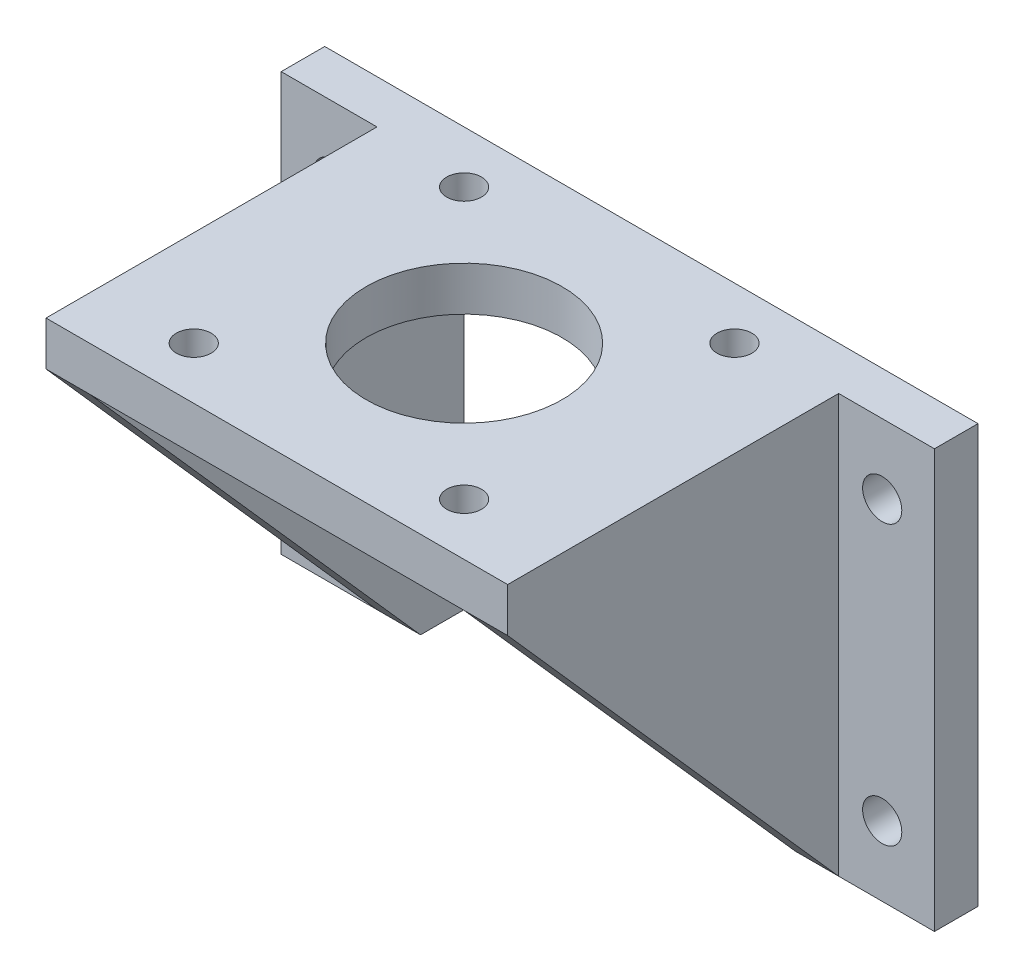
ISO-10303-21;
HEADER;
FILE_DESCRIPTION(('STEP AP214'),'2;1');
FILE_NAME('part.step','',(''),(''),'','','');
FILE_SCHEMA(('AUTOMOTIVE_DESIGN { 1 0 10303 214 1 1 1 1 }'));
ENDSEC;
DATA;
#1=APPLICATION_CONTEXT('core data for automotive mechanical design processes');
#2=APPLICATION_PROTOCOL_DEFINITION('international standard','automotive_design',2000,#1);
#3=PRODUCT_CONTEXT('',#1,'mechanical');
#4=PRODUCT('Part','Part','',(#3));
#5=PRODUCT_RELATED_PRODUCT_CATEGORY('part','',(#4));
#6=PRODUCT_DEFINITION_FORMATION('','',#4);
#7=PRODUCT_DEFINITION_CONTEXT('part definition',#1,'design');
#8=PRODUCT_DEFINITION('design','',#6,#7);
#9=PRODUCT_DEFINITION_SHAPE('','',#8);
#10=(LENGTH_UNIT() NAMED_UNIT(*) SI_UNIT(.MILLI.,.METRE.));
#11=(NAMED_UNIT(*) PLANE_ANGLE_UNIT() SI_UNIT($,.RADIAN.));
#12=(NAMED_UNIT(*) SI_UNIT($,.STERADIAN.) SOLID_ANGLE_UNIT());
#13=UNCERTAINTY_MEASURE_WITH_UNIT(LENGTH_MEASURE(1.E-05),#10,'distance_accuracy_value','');
#14=(GEOMETRIC_REPRESENTATION_CONTEXT(3) GLOBAL_UNCERTAINTY_ASSIGNED_CONTEXT((#13)) GLOBAL_UNIT_ASSIGNED_CONTEXT((#10,
#11,#12)) REPRESENTATION_CONTEXT('',''));
#15=CARTESIAN_POINT('',(0.,0.,0.));
#16=DIRECTION('',(0.,0.,1.));
#17=DIRECTION('',(1.,0.,0.));
#18=AXIS2_PLACEMENT_3D('',#15,#16,#17);
#19=CARTESIAN_POINT('',(0.,0.,5.));
#20=DIRECTION('',(0.,0.,-1.));
#21=DIRECTION('',(-1.,0.,0.));
#22=AXIS2_PLACEMENT_3D('',#19,#20,#21);
#23=PLANE('',#22);
#24=DIRECTION('',(0.,1.,0.));
#25=VECTOR('',#24,1.);
#26=CARTESIAN_POINT('',(35.2765551342242,0.,5.));
#27=LINE('',#26,#25);
#28=CARTESIAN_POINT('',(35.2765551342242,42.930717043,5.));
#29=VERTEX_POINT('',#28);
#30=CARTESIAN_POINT('',(35.2765551342242,43.,5.));
#31=VERTEX_POINT('',#30);
#32=EDGE_CURVE('E11',#29,#31,#27,.T.);
#33=ORIENTED_EDGE('',*,*,#32,.F.);
#34=DIRECTION('',(1.,0.,0.));
#35=VECTOR('',#34,1.);
#36=CARTESIAN_POINT('',(-5.,42.930717043,5.));
#37=LINE('',#36,#35);
#38=CARTESIAN_POINT('',(7.72344486577579,42.930717043,5.));
#39=VERTEX_POINT('',#38);
#40=EDGE_CURVE('E170',#39,#29,#37,.T.);
#41=ORIENTED_EDGE('',*,*,#40,.F.);
#42=DIRECTION('',(0.,1.,0.));
#43=VECTOR('',#42,1.);
#44=CARTESIAN_POINT('',(7.7234448657758,0.,5.));
#45=LINE('',#44,#43);
#46=CARTESIAN_POINT('',(7.72344486577579,43.,5.));
#47=VERTEX_POINT('',#46);
#48=EDGE_CURVE('E262',#47,#39,#45,.F.);
#49=ORIENTED_EDGE('',*,*,#48,.F.);
#50=DIRECTION('',(1.,0.,0.));
#51=VECTOR('',#50,1.);
#52=CARTESIAN_POINT('',(0.,43.,5.));
#53=LINE('',#52,#51);
#54=EDGE_CURVE('E241',#47,#31,#53,.T.);
#55=ORIENTED_EDGE('',*,*,#54,.T.);
#56=EDGE_LOOP('',(#33,#41,#49,#55));
#57=FACE_BOUND('',#56,.T.);
#58=ADVANCED_FACE('F32',(#57),#23,.T.);
#59=DIRECTION('',(0.,1.,0.));
#60=VECTOR('',#59,1.);
#61=CARTESIAN_POINT('',(4.2365551342242,0.,5.));
#62=LINE('',#61,#60);
#63=CARTESIAN_POINT('',(4.23655513422419,42.930717043,5.));
#64=VERTEX_POINT('',#63);
#65=CARTESIAN_POINT('',(4.23655513422419,43.,5.));
#66=VERTEX_POINT('',#65);
#67=EDGE_CURVE('E161',#64,#66,#62,.T.);
#68=ORIENTED_EDGE('',*,*,#67,.F.);
#69=CARTESIAN_POINT('',(0.,42.930717043,5.));
#70=VERTEX_POINT('',#69);
#71=EDGE_CURVE('E179',#70,#64,#37,.T.);
#72=ORIENTED_EDGE('',*,*,#71,.F.);
#73=DIRECTION('',(0.,1.,0.));
#74=VECTOR('',#73,1.);
#75=CARTESIAN_POINT('',(0.,0.,5.));
#76=LINE('',#75,#74);
#77=CARTESIAN_POINT('',(0.,43.,5.));
#78=VERTEX_POINT('',#77);
#79=EDGE_CURVE('E233',#70,#78,#76,.T.);
#80=ORIENTED_EDGE('',*,*,#79,.T.);
#81=EDGE_CURVE('E238',#78,#66,#53,.T.);
#82=ORIENTED_EDGE('',*,*,#81,.T.);
#83=EDGE_LOOP('',(#68,#72,#80,#82));
#84=FACE_BOUND('',#83,.T.);
#85=ADVANCED_FACE('F414',(#84),#23,.T.);
#86=CARTESIAN_POINT('',(-5.,42.930717043,43.));
#87=DIRECTION('',(0.,1.,0.));
#88=DIRECTION('',(0.,0.,1.));
#89=AXIS2_PLACEMENT_3D('',#86,#87,#88);
#90=PLANE('',#89);
#91=CARTESIAN_POINT('',(5.98000000000032,42.930717043,37.02));
#92=DIRECTION('',(0.,1.,0.));
#93=DIRECTION('',(0.,0.,1.));
#94=AXIS2_PLACEMENT_3D('',#91,#92,#93);
#95=CIRCLE('',#94,2.);
#96=CARTESIAN_POINT('',(5.98000000000032,42.930717043,39.02));
#97=VERTEX_POINT('',#96);
#98=EDGE_CURVE('E381',#97,#97,#95,.T.);
#99=ORIENTED_EDGE('',*,*,#98,.T.);
#100=EDGE_LOOP('',(#99));
#101=FACE_BOUND('',#100,.T.);
#102=CARTESIAN_POINT('',(37.0200000000003,42.930717043,37.02));
#103=DIRECTION('',(0.,1.,0.));
#104=DIRECTION('',(0.,0.,1.));
#105=AXIS2_PLACEMENT_3D('',#102,#103,#104);
#106=CIRCLE('',#105,2.);
#107=CARTESIAN_POINT('',(37.0200000000003,42.930717043,39.02));
#108=VERTEX_POINT('',#107);
#109=EDGE_CURVE('E375',#108,#108,#106,.T.);
#110=ORIENTED_EDGE('',*,*,#109,.T.);
#111=EDGE_LOOP('',(#110));
#112=FACE_BOUND('',#111,.T.);
#113=CARTESIAN_POINT('',(21.5,42.930717043,21.5));
#114=DIRECTION('',(0.,1.,0.));
#115=DIRECTION('',(0.,0.,1.));
#116=AXIS2_PLACEMENT_3D('',#113,#114,#115);
#117=CIRCLE('',#116,11.25);
#118=CARTESIAN_POINT('',(21.5,42.930717043,32.75));
#119=VERTEX_POINT('',#118);
#120=EDGE_CURVE('E359',#119,#119,#117,.T.);
#121=ORIENTED_EDGE('',*,*,#120,.T.);
#122=EDGE_LOOP('',(#121));
#123=FACE_BOUND('',#122,.T.);
#124=ORIENTED_EDGE('',*,*,#40,.T.);
#125=CARTESIAN_POINT('',(37.02,42.930717043,5.98));
#126=DIRECTION('',(0.,1.,0.));
#127=DIRECTION('',(0.,0.,1.));
#128=AXIS2_PLACEMENT_3D('',#125,#126,#127);
#129=CIRCLE('',#128,2.);
#130=CARTESIAN_POINT('',(38.7634448657758,42.930717043,5.));
#131=VERTEX_POINT('',#130);
#132=EDGE_CURVE('E156',#29,#131,#129,.T.);
#133=ORIENTED_EDGE('',*,*,#132,.T.);
#134=CARTESIAN_POINT('',(43.,42.930717043,5.));
#135=VERTEX_POINT('',#134);
#136=EDGE_CURVE('E166',#131,#135,#37,.T.);
#137=ORIENTED_EDGE('',*,*,#136,.T.);
#138=DIRECTION('',(0.,0.,-1.));
#139=VECTOR('',#138,1.);
#140=CARTESIAN_POINT('',(43.,42.930717043,43.));
#141=LINE('',#140,#139);
#142=CARTESIAN_POINT('',(43.,42.930717043,43.));
#143=VERTEX_POINT('',#142);
#144=EDGE_CURVE('E323',#143,#135,#141,.T.);
#145=ORIENTED_EDGE('',*,*,#144,.F.);
#146=DIRECTION('',(1.,0.,0.));
#147=VECTOR('',#146,1.);
#148=CARTESIAN_POINT('',(-5.,42.930717043,43.));
#149=LINE('',#148,#147);
#150=CARTESIAN_POINT('',(0.,42.930717043,43.));
#151=VERTEX_POINT('',#150);
#152=EDGE_CURVE('E195',#151,#143,#149,.T.);
#153=ORIENTED_EDGE('',*,*,#152,.F.);
#154=DIRECTION('',(0.,0.,1.));
#155=VECTOR('',#154,1.);
#156=CARTESIAN_POINT('',(0.,42.930717043,43.));
#157=LINE('',#156,#155);
#158=EDGE_CURVE('E180',#70,#151,#157,.T.);
#159=ORIENTED_EDGE('',*,*,#158,.F.);
#160=ORIENTED_EDGE('',*,*,#71,.T.);
#161=CARTESIAN_POINT('',(5.97999999999999,42.930717043,5.98));
#162=DIRECTION('',(0.,1.,0.));
#163=DIRECTION('',(0.,0.,1.));
#164=AXIS2_PLACEMENT_3D('',#161,#162,#163);
#165=CIRCLE('',#164,2.);
#166=EDGE_CURVE('E366',#64,#39,#165,.T.);
#167=ORIENTED_EDGE('',*,*,#166,.T.);
#168=EDGE_LOOP('',(#124,#133,#137,#145,#153,#159,#160,#167));
#169=FACE_BOUND('',#168,.T.);
#170=ADVANCED_FACE('F164',(#101,#112,#123,#169),#90,.F.);
#171=CARTESIAN_POINT('',(0.,0.,5.));
#172=DIRECTION('',(0.,0.,1.));
#173=DIRECTION('',(1.,0.,0.));
#174=AXIS2_PLACEMENT_3D('',#171,#172,#173);
#175=PLANE('',#174);
#176=DIRECTION('',(1.,0.,0.));
#177=VECTOR('',#176,1.);
#178=CARTESIAN_POINT('',(-16.,0.,5.));
#179=LINE('',#178,#177);
#180=CARTESIAN_POINT('',(-16.,0.,5.));
#181=VERTEX_POINT('',#180);
#182=CARTESIAN_POINT('',(-5.,0.,5.));
#183=VERTEX_POINT('',#182);
#184=EDGE_CURVE('E230',#181,#183,#179,.T.);
#185=ORIENTED_EDGE('',*,*,#184,.T.);
#186=DIRECTION('',(0.,-1.,0.));
#187=VECTOR('',#186,1.);
#188=CARTESIAN_POINT('',(-5.,42.930717043,5.));
#189=LINE('',#188,#187);
#190=CARTESIAN_POINT('',(-5.,48.,5.));
#191=VERTEX_POINT('',#190);
#192=EDGE_CURVE('E177',#191,#183,#189,.T.);
#193=ORIENTED_EDGE('',*,*,#192,.F.);
#194=DIRECTION('',(-1.,0.,0.));
#195=VECTOR('',#194,1.);
#196=CARTESIAN_POINT('',(59.,48.,5.));
#197=LINE('',#196,#195);
#198=CARTESIAN_POINT('',(-16.,48.,5.));
#199=VERTEX_POINT('',#198);
#200=EDGE_CURVE('E249',#191,#199,#197,.T.);
#201=ORIENTED_EDGE('',*,*,#200,.T.);
#202=DIRECTION('',(0.,-1.,0.));
#203=VECTOR('',#202,1.);
#204=CARTESIAN_POINT('',(-16.,48.,5.));
#205=LINE('',#204,#203);
#206=EDGE_CURVE('E252',#199,#181,#205,.T.);
#207=ORIENTED_EDGE('',*,*,#206,.T.);
#208=EDGE_LOOP('',(#185,#193,#201,#207));
#209=FACE_BOUND('',#208,.T.);
#210=CARTESIAN_POINT('',(-9.99999999999967,8.,5.));
#211=DIRECTION('',(0.,0.,1.));
#212=DIRECTION('',(1.,0.,0.));
#213=AXIS2_PLACEMENT_3D('',#210,#211,#212);
#214=CIRCLE('',#213,2.25);
#215=CARTESIAN_POINT('',(-7.74999999999967,8.,5.));
#216=VERTEX_POINT('',#215);
#217=EDGE_CURVE('E205',#216,#216,#214,.T.);
#218=ORIENTED_EDGE('',*,*,#217,.F.);
#219=EDGE_LOOP('',(#218));
#220=FACE_BOUND('',#219,.T.);
#221=CARTESIAN_POINT('',(-10.,40.,5.));
#222=DIRECTION('',(0.,0.,1.));
#223=DIRECTION('',(1.,0.,0.));
#224=AXIS2_PLACEMENT_3D('',#221,#222,#223);
#225=CIRCLE('',#224,2.25);
#226=CARTESIAN_POINT('',(-7.75,40.,5.));
#227=VERTEX_POINT('',#226);
#228=EDGE_CURVE('E224',#227,#227,#225,.T.);
#229=ORIENTED_EDGE('',*,*,#228,.F.);
#230=EDGE_LOOP('',(#229));
#231=FACE_BOUND('',#230,.T.);
#232=ADVANCED_FACE('F413',(#209,#220,#231),#175,.T.);
#233=DIRECTION('',(0.,1.,0.));
#234=VECTOR('',#233,1.);
#235=CARTESIAN_POINT('',(48.,42.930717043,5.));
#236=LINE('',#235,#234);
#237=CARTESIAN_POINT('',(48.,0.,5.));
#238=VERTEX_POINT('',#237);
#239=CARTESIAN_POINT('',(48.,48.,5.));
#240=VERTEX_POINT('',#239);
#241=EDGE_CURVE('E185',#238,#240,#236,.T.);
#242=ORIENTED_EDGE('',*,*,#241,.F.);
#243=DIRECTION('',(1.,0.,0.));
#244=VECTOR('',#243,1.);
#245=CARTESIAN_POINT('',(43.,0.,5.));
#246=LINE('',#245,#244);
#247=CARTESIAN_POINT('',(59.,0.,5.));
#248=VERTEX_POINT('',#247);
#249=EDGE_CURVE('E243',#238,#248,#246,.T.);
#250=ORIENTED_EDGE('',*,*,#249,.T.);
#251=DIRECTION('',(0.,1.,0.));
#252=VECTOR('',#251,1.);
#253=CARTESIAN_POINT('',(59.,0.,5.));
#254=LINE('',#253,#252);
#255=CARTESIAN_POINT('',(59.,48.,5.));
#256=VERTEX_POINT('',#255);
#257=EDGE_CURVE('E247',#248,#256,#254,.T.);
#258=ORIENTED_EDGE('',*,*,#257,.T.);
#259=EDGE_CURVE('E257',#256,#240,#197,.T.);
#260=ORIENTED_EDGE('',*,*,#259,.T.);
#261=EDGE_LOOP('',(#242,#250,#258,#260));
#262=FACE_BOUND('',#261,.T.);
#263=CARTESIAN_POINT('',(53.0000000000008,8.,5.));
#264=DIRECTION('',(0.,0.,1.));
#265=DIRECTION('',(1.,0.,0.));
#266=AXIS2_PLACEMENT_3D('',#263,#264,#265);
#267=CIRCLE('',#266,2.25);
#268=CARTESIAN_POINT('',(55.2500000000008,8.,5.));
#269=VERTEX_POINT('',#268);
#270=EDGE_CURVE('E212',#269,#269,#267,.T.);
#271=ORIENTED_EDGE('',*,*,#270,.F.);
#272=EDGE_LOOP('',(#271));
#273=FACE_BOUND('',#272,.T.);
#274=CARTESIAN_POINT('',(53.,40.,5.));
#275=DIRECTION('',(0.,0.,1.));
#276=DIRECTION('',(1.,0.,0.));
#277=AXIS2_PLACEMENT_3D('',#274,#275,#276);
#278=CIRCLE('',#277,2.25);
#279=CARTESIAN_POINT('',(55.25,40.,5.));
#280=VERTEX_POINT('',#279);
#281=EDGE_CURVE('E218',#280,#280,#278,.T.);
#282=ORIENTED_EDGE('',*,*,#281,.F.);
#283=EDGE_LOOP('',(#282));
#284=FACE_BOUND('',#283,.T.);
#285=ADVANCED_FACE('F421',(#262,#273,#284),#175,.T.);
#286=CARTESIAN_POINT('',(0.,0.,0.));
#287=DIRECTION('',(0.,0.,1.));
#288=DIRECTION('',(1.,0.,0.));
#289=AXIS2_PLACEMENT_3D('',#286,#287,#288);
#290=PLANE('',#289);
#291=CARTESIAN_POINT('',(53.0000000000008,8.,0.));
#292=DIRECTION('',(0.,0.,1.));
#293=DIRECTION('',(1.,0.,0.));
#294=AXIS2_PLACEMENT_3D('',#291,#292,#293);
#295=CIRCLE('',#294,2.25);
#296=CARTESIAN_POINT('',(55.2500000000008,8.,0.));
#297=VERTEX_POINT('',#296);
#298=EDGE_CURVE('E208',#297,#297,#295,.T.);
#299=ORIENTED_EDGE('',*,*,#298,.T.);
#300=EDGE_LOOP('',(#299));
#301=FACE_BOUND('',#300,.T.);
#302=CARTESIAN_POINT('',(-10.,40.,0.));
#303=DIRECTION('',(0.,0.,1.));
#304=DIRECTION('',(1.,0.,0.));
#305=AXIS2_PLACEMENT_3D('',#302,#303,#304);
#306=CIRCLE('',#305,2.25);
#307=CARTESIAN_POINT('',(-7.75,40.,0.));
#308=VERTEX_POINT('',#307);
#309=EDGE_CURVE('E221',#308,#308,#306,.T.);
#310=ORIENTED_EDGE('',*,*,#309,.T.);
#311=EDGE_LOOP('',(#310));
#312=FACE_BOUND('',#311,.T.);
#313=DIRECTION('',(1.,0.,0.));
#314=VECTOR('',#313,1.);
#315=CARTESIAN_POINT('',(-16.,0.,0.));
#316=LINE('',#315,#314);
#317=CARTESIAN_POINT('',(-16.,0.,0.));
#318=VERTEX_POINT('',#317);
#319=CARTESIAN_POINT('',(0.,0.,0.));
#320=VERTEX_POINT('',#319);
#321=EDGE_CURVE('E227',#318,#320,#316,.T.);
#322=ORIENTED_EDGE('',*,*,#321,.F.);
#323=DIRECTION('',(0.,-1.,0.));
#324=VECTOR('',#323,1.);
#325=CARTESIAN_POINT('',(-16.,48.,0.));
#326=LINE('',#325,#324);
#327=CARTESIAN_POINT('',(-16.,48.,0.));
#328=VERTEX_POINT('',#327);
#329=EDGE_CURVE('E234',#328,#318,#326,.T.);
#330=ORIENTED_EDGE('',*,*,#329,.F.);
#331=DIRECTION('',(-1.,0.,0.));
#332=VECTOR('',#331,1.);
#333=CARTESIAN_POINT('',(59.,48.,0.));
#334=LINE('',#333,#332);
#335=CARTESIAN_POINT('',(59.,48.,0.));
#336=VERTEX_POINT('',#335);
#337=EDGE_CURVE('E285',#336,#328,#334,.T.);
#338=ORIENTED_EDGE('',*,*,#337,.F.);
#339=DIRECTION('',(0.,1.,0.));
#340=VECTOR('',#339,1.);
#341=CARTESIAN_POINT('',(59.,0.,0.));
#342=LINE('',#341,#340);
#343=CARTESIAN_POINT('',(59.,0.,0.));
#344=VERTEX_POINT('',#343);
#345=EDGE_CURVE('E287',#344,#336,#342,.T.);
#346=ORIENTED_EDGE('',*,*,#345,.F.);
#347=DIRECTION('',(1.,0.,0.));
#348=VECTOR('',#347,1.);
#349=CARTESIAN_POINT('',(43.,0.,0.));
#350=LINE('',#349,#348);
#351=CARTESIAN_POINT('',(43.,0.,0.));
#352=VERTEX_POINT('',#351);
#353=EDGE_CURVE('E289',#352,#344,#350,.T.);
#354=ORIENTED_EDGE('',*,*,#353,.F.);
#355=DIRECTION('',(0.,-1.,0.));
#356=VECTOR('',#355,1.);
#357=CARTESIAN_POINT('',(43.,43.,0.));
#358=LINE('',#357,#356);
#359=CARTESIAN_POINT('',(43.,43.,0.));
#360=VERTEX_POINT('',#359);
#361=EDGE_CURVE('E291',#360,#352,#358,.T.);
#362=ORIENTED_EDGE('',*,*,#361,.F.);
#363=DIRECTION('',(1.,0.,0.));
#364=VECTOR('',#363,1.);
#365=CARTESIAN_POINT('',(0.,43.,0.));
#366=LINE('',#365,#364);
#367=CARTESIAN_POINT('',(0.,43.,0.));
#368=VERTEX_POINT('',#367);
#369=EDGE_CURVE('E293',#368,#360,#366,.T.);
#370=ORIENTED_EDGE('',*,*,#369,.F.);
#371=DIRECTION('',(0.,1.,0.));
#372=VECTOR('',#371,1.);
#373=CARTESIAN_POINT('',(0.,0.,0.));
#374=LINE('',#373,#372);
#375=EDGE_CURVE('E295',#320,#368,#374,.T.);
#376=ORIENTED_EDGE('',*,*,#375,.F.);
#377=EDGE_LOOP('',(#322,#330,#338,#346,#354,#362,#370,#376));
#378=FACE_BOUND('',#377,.T.);
#379=CARTESIAN_POINT('',(53.,40.,0.));
#380=DIRECTION('',(0.,0.,1.));
#381=DIRECTION('',(1.,0.,0.));
#382=AXIS2_PLACEMENT_3D('',#379,#380,#381);
#383=CIRCLE('',#382,2.25);
#384=CARTESIAN_POINT('',(55.25,40.,0.));
#385=VERTEX_POINT('',#384);
#386=EDGE_CURVE('E215',#385,#385,#383,.T.);
#387=ORIENTED_EDGE('',*,*,#386,.T.);
#388=EDGE_LOOP('',(#387));
#389=FACE_BOUND('',#388,.T.);
#390=CARTESIAN_POINT('',(-9.99999999999967,8.,0.));
#391=DIRECTION('',(0.,0.,1.));
#392=DIRECTION('',(1.,0.,0.));
#393=AXIS2_PLACEMENT_3D('',#390,#391,#392);
#394=CIRCLE('',#393,2.25);
#395=CARTESIAN_POINT('',(-7.74999999999967,8.,0.));
#396=VERTEX_POINT('',#395);
#397=EDGE_CURVE('E209',#396,#396,#394,.T.);
#398=ORIENTED_EDGE('',*,*,#397,.T.);
#399=EDGE_LOOP('',(#398));
#400=FACE_BOUND('',#399,.T.);
#401=ADVANCED_FACE('F305',(#301,#312,#378,#389,#400),#290,.F.);
#402=CARTESIAN_POINT('',(-16.,0.,5.));
#403=DIRECTION('',(0.,1.,0.));
#404=DIRECTION('',(0.,0.,1.));
#405=AXIS2_PLACEMENT_3D('',#402,#403,#404);
#406=PLANE('',#405);
#407=ORIENTED_EDGE('',*,*,#321,.T.);
#408=DIRECTION('',(0.,0.,-1.));
#409=VECTOR('',#408,1.);
#410=CARTESIAN_POINT('',(0.,0.,5.));
#411=LINE('',#410,#409);
#412=CARTESIAN_POINT('',(0.,0.,5.));
#413=VERTEX_POINT('',#412);
#414=EDGE_CURVE('E259',#413,#320,#411,.T.);
#415=ORIENTED_EDGE('',*,*,#414,.F.);
#416=DIRECTION('',(-1.,0.,0.));
#417=VECTOR('',#416,1.);
#418=CARTESIAN_POINT('',(0.,0.,5.));
#419=LINE('',#418,#417);
#420=EDGE_CURVE('E318',#413,#183,#419,.T.);
#421=ORIENTED_EDGE('',*,*,#420,.T.);
#422=ORIENTED_EDGE('',*,*,#184,.F.);
#423=DIRECTION('',(0.,0.,-1.));
#424=VECTOR('',#423,1.);
#425=CARTESIAN_POINT('',(-16.,0.,5.));
#426=LINE('',#425,#424);
#427=EDGE_CURVE('E281',#181,#318,#426,.T.);
#428=ORIENTED_EDGE('',*,*,#427,.T.);
#429=EDGE_LOOP('',(#407,#415,#421,#422,#428));
#430=FACE_BOUND('',#429,.T.);
#431=ADVANCED_FACE('F34',(#430),#406,.F.);
#432=CARTESIAN_POINT('',(0.,0.,5.));
#433=DIRECTION('',(-1.,0.,0.));
#434=DIRECTION('',(0.,-1.,0.));
#435=AXIS2_PLACEMENT_3D('',#432,#433,#434);
#436=PLANE('',#435);
#437=ORIENTED_EDGE('',*,*,#375,.T.);
#438=DIRECTION('',(0.,0.,-1.));
#439=VECTOR('',#438,1.);
#440=CARTESIAN_POINT('',(0.,43.,5.));
#441=LINE('',#440,#439);
#442=EDGE_CURVE('E263',#78,#368,#441,.T.);
#443=ORIENTED_EDGE('',*,*,#442,.F.);
#444=ORIENTED_EDGE('',*,*,#79,.F.);
#445=ORIENTED_EDGE('',*,*,#158,.T.);
#446=DIRECTION('',(0.,0.748798939416669,0.662797215088048));
#447=VECTOR('',#446,1.);
#448=CARTESIAN_POINT('',(0.,0.,5.));
#449=LINE('',#448,#447);
#450=EDGE_CURVE('E314',#413,#151,#449,.T.);
#451=ORIENTED_EDGE('',*,*,#450,.F.);
#452=ORIENTED_EDGE('',*,*,#414,.T.);
#453=EDGE_LOOP('',(#437,#443,#444,#445,#451,#452));
#454=FACE_BOUND('',#453,.T.);
#455=ADVANCED_FACE('F312',(#454),#436,.F.);
#456=CARTESIAN_POINT('',(0.,43.,5.));
#457=DIRECTION('',(0.,1.,0.));
#458=DIRECTION('',(-1.,0.,0.));
#459=AXIS2_PLACEMENT_3D('',#456,#457,#458);
#460=PLANE('',#459);
#461=CARTESIAN_POINT('',(38.7634448657758,43.,5.));
#462=VERTEX_POINT('',#461);
#463=CARTESIAN_POINT('',(43.,43.,5.));
#464=VERTEX_POINT('',#463);
#465=EDGE_CURVE('E237',#462,#464,#53,.T.);
#466=ORIENTED_EDGE('',*,*,#465,.F.);
#467=CARTESIAN_POINT('',(37.02,43.,5.98));
#468=DIRECTION('',(0.,1.,0.));
#469=DIRECTION('',(-1.,0.,0.));
#470=AXIS2_PLACEMENT_3D('',#467,#468,#469);
#471=CIRCLE('',#470,2.);
#472=EDGE_CURVE('E46',#462,#31,#471,.T.);
#473=ORIENTED_EDGE('',*,*,#472,.T.);
#474=ORIENTED_EDGE('',*,*,#54,.F.);
#475=CARTESIAN_POINT('',(5.97999999999999,43.,5.98));
#476=DIRECTION('',(0.,1.,0.));
#477=DIRECTION('',(-1.,0.,0.));
#478=AXIS2_PLACEMENT_3D('',#475,#476,#477);
#479=CIRCLE('',#478,2.);
#480=EDGE_CURVE('E54',#47,#66,#479,.T.);
#481=ORIENTED_EDGE('',*,*,#480,.T.);
#482=ORIENTED_EDGE('',*,*,#81,.F.);
#483=ORIENTED_EDGE('',*,*,#442,.T.);
#484=ORIENTED_EDGE('',*,*,#369,.T.);
#485=DIRECTION('',(0.,0.,-1.));
#486=VECTOR('',#485,1.);
#487=CARTESIAN_POINT('',(43.,43.,5.));
#488=LINE('',#487,#486);
#489=EDGE_CURVE('E266',#464,#360,#488,.T.);
#490=ORIENTED_EDGE('',*,*,#489,.F.);
#491=EDGE_LOOP('',(#466,#473,#474,#481,#482,#483,#484,#490));
#492=FACE_BOUND('',#491,.T.);
#493=ADVANCED_FACE('F510',(#492),#460,.F.);
#494=CARTESIAN_POINT('',(43.,43.,5.));
#495=DIRECTION('',(1.,0.,0.));
#496=DIRECTION('',(0.,1.,0.));
#497=AXIS2_PLACEMENT_3D('',#494,#495,#496);
#498=PLANE('',#497);
#499=ORIENTED_EDGE('',*,*,#361,.T.);
#500=DIRECTION('',(0.,0.,-1.));
#501=VECTOR('',#500,1.);
#502=CARTESIAN_POINT('',(43.,0.,5.));
#503=LINE('',#502,#501);
#504=CARTESIAN_POINT('',(43.,0.,5.));
#505=VERTEX_POINT('',#504);
#506=EDGE_CURVE('E269',#505,#352,#503,.T.);
#507=ORIENTED_EDGE('',*,*,#506,.F.);
#508=DIRECTION('',(0.,-0.748798939416669,-0.662797215088048));
#509=VECTOR('',#508,1.);
#510=CARTESIAN_POINT('',(43.,42.930717043,43.));
#511=LINE('',#510,#509);
#512=EDGE_CURVE('E356',#143,#505,#511,.T.);
#513=ORIENTED_EDGE('',*,*,#512,.F.);
#514=ORIENTED_EDGE('',*,*,#144,.T.);
#515=DIRECTION('',(0.,-1.,0.));
#516=VECTOR('',#515,1.);
#517=CARTESIAN_POINT('',(43.,43.,5.));
#518=LINE('',#517,#516);
#519=EDGE_CURVE('E176',#464,#135,#518,.T.);
#520=ORIENTED_EDGE('',*,*,#519,.F.);
#521=ORIENTED_EDGE('',*,*,#489,.T.);
#522=EDGE_LOOP('',(#499,#507,#513,#514,#520,#521));
#523=FACE_BOUND('',#522,.T.);
#524=ADVANCED_FACE('F504',(#523),#498,.F.);
#525=CARTESIAN_POINT('',(43.,0.,5.));
#526=DIRECTION('',(0.,1.,0.));
#527=DIRECTION('',(0.,0.,1.));
#528=AXIS2_PLACEMENT_3D('',#525,#526,#527);
#529=PLANE('',#528);
#530=ORIENTED_EDGE('',*,*,#353,.T.);
#531=DIRECTION('',(0.,0.,-1.));
#532=VECTOR('',#531,1.);
#533=CARTESIAN_POINT('',(59.,0.,5.));
#534=LINE('',#533,#532);
#535=EDGE_CURVE('E272',#248,#344,#534,.T.);
#536=ORIENTED_EDGE('',*,*,#535,.F.);
#537=ORIENTED_EDGE('',*,*,#249,.F.);
#538=EDGE_CURVE('E244',#505,#238,#246,.T.);
#539=ORIENTED_EDGE('',*,*,#538,.F.);
#540=ORIENTED_EDGE('',*,*,#506,.T.);
#541=EDGE_LOOP('',(#530,#536,#537,#539,#540));
#542=FACE_BOUND('',#541,.T.);
#543=ADVANCED_FACE('F509',(#542),#529,.F.);
#544=CARTESIAN_POINT('',(59.,0.,5.));
#545=DIRECTION('',(-1.,0.,0.));
#546=DIRECTION('',(0.,0.,1.));
#547=AXIS2_PLACEMENT_3D('',#544,#545,#546);
#548=PLANE('',#547);
#549=ORIENTED_EDGE('',*,*,#345,.T.);
#550=DIRECTION('',(0.,0.,-1.));
#551=VECTOR('',#550,1.);
#552=CARTESIAN_POINT('',(59.,48.,5.));
#553=LINE('',#552,#551);
#554=EDGE_CURVE('E275',#256,#336,#553,.T.);
#555=ORIENTED_EDGE('',*,*,#554,.F.);
#556=ORIENTED_EDGE('',*,*,#257,.F.);
#557=ORIENTED_EDGE('',*,*,#535,.T.);
#558=EDGE_LOOP('',(#549,#555,#556,#557));
#559=FACE_BOUND('',#558,.T.);
#560=ADVANCED_FACE('F394',(#559),#548,.F.);
#561=CARTESIAN_POINT('',(59.,48.,5.));
#562=DIRECTION('',(0.,-1.,0.));
#563=DIRECTION('',(1.,0.,0.));
#564=AXIS2_PLACEMENT_3D('',#561,#562,#563);
#565=PLANE('',#564);
#566=CARTESIAN_POINT('',(5.98000000000032,48.,37.02));
#567=DIRECTION('',(0.,1.,0.));
#568=DIRECTION('',(-1.,0.,0.));
#569=AXIS2_PLACEMENT_3D('',#566,#567,#568);
#570=CIRCLE('',#569,2.);
#571=CARTESIAN_POINT('',(3.98000000000032,48.,37.02));
#572=VERTEX_POINT('',#571);
#573=EDGE_CURVE('E384',#572,#572,#570,.T.);
#574=ORIENTED_EDGE('',*,*,#573,.F.);
#575=EDGE_LOOP('',(#574));
#576=FACE_BOUND('',#575,.T.);
#577=CARTESIAN_POINT('',(37.0200000000003,48.,37.02));
#578=DIRECTION('',(0.,1.,0.));
#579=DIRECTION('',(-1.,0.,0.));
#580=AXIS2_PLACEMENT_3D('',#577,#578,#579);
#581=CIRCLE('',#580,2.);
#582=CARTESIAN_POINT('',(35.0200000000003,48.,37.02));
#583=VERTEX_POINT('',#582);
#584=EDGE_CURVE('E378',#583,#583,#581,.T.);
#585=ORIENTED_EDGE('',*,*,#584,.F.);
#586=EDGE_LOOP('',(#585));
#587=FACE_BOUND('',#586,.T.);
#588=CARTESIAN_POINT('',(37.02,48.,5.98));
#589=DIRECTION('',(0.,1.,0.));
#590=DIRECTION('',(-1.,0.,0.));
#591=AXIS2_PLACEMENT_3D('',#588,#589,#590);
#592=CIRCLE('',#591,2.);
#593=CARTESIAN_POINT('',(35.02,48.,5.98));
#594=VERTEX_POINT('',#593);
#595=EDGE_CURVE('E372',#594,#594,#592,.T.);
#596=ORIENTED_EDGE('',*,*,#595,.F.);
#597=EDGE_LOOP('',(#596));
#598=FACE_BOUND('',#597,.T.);
#599=CARTESIAN_POINT('',(5.97999999999999,48.,5.98));
#600=DIRECTION('',(0.,1.,0.));
#601=DIRECTION('',(-1.,0.,0.));
#602=AXIS2_PLACEMENT_3D('',#599,#600,#601);
#603=CIRCLE('',#602,2.);
#604=CARTESIAN_POINT('',(3.97999999999999,48.,5.98));
#605=VERTEX_POINT('',#604);
#606=EDGE_CURVE('E171',#605,#605,#603,.T.);
#607=ORIENTED_EDGE('',*,*,#606,.F.);
#608=EDGE_LOOP('',(#607));
#609=FACE_BOUND('',#608,.T.);
#610=CARTESIAN_POINT('',(21.5,48.,21.5));
#611=DIRECTION('',(0.,1.,0.));
#612=DIRECTION('',(-1.,0.,0.));
#613=AXIS2_PLACEMENT_3D('',#610,#611,#612);
#614=CIRCLE('',#613,11.25);
#615=CARTESIAN_POINT('',(10.25,48.,21.5));
#616=VERTEX_POINT('',#615);
#617=EDGE_CURVE('E363',#616,#616,#614,.T.);
#618=ORIENTED_EDGE('',*,*,#617,.F.);
#619=EDGE_LOOP('',(#618));
#620=FACE_BOUND('',#619,.T.);
#621=DIRECTION('',(0.,0.,-1.));
#622=VECTOR('',#621,1.);
#623=CARTESIAN_POINT('',(48.,48.,43.));
#624=LINE('',#623,#622);
#625=CARTESIAN_POINT('',(48.,48.,43.));
#626=VERTEX_POINT('',#625);
#627=EDGE_CURVE('E201',#626,#240,#624,.T.);
#628=ORIENTED_EDGE('',*,*,#627,.T.);
#629=ORIENTED_EDGE('',*,*,#259,.F.);
#630=ORIENTED_EDGE('',*,*,#554,.T.);
#631=ORIENTED_EDGE('',*,*,#337,.T.);
#632=DIRECTION('',(0.,0.,-1.));
#633=VECTOR('',#632,1.);
#634=CARTESIAN_POINT('',(-16.,48.,5.));
#635=LINE('',#634,#633);
#636=EDGE_CURVE('E278',#199,#328,#635,.T.);
#637=ORIENTED_EDGE('',*,*,#636,.F.);
#638=ORIENTED_EDGE('',*,*,#200,.F.);
#639=DIRECTION('',(0.,0.,-1.));
#640=VECTOR('',#639,1.);
#641=CARTESIAN_POINT('',(-5.,48.,43.));
#642=LINE('',#641,#640);
#643=CARTESIAN_POINT('',(-5.,48.,43.));
#644=VERTEX_POINT('',#643);
#645=EDGE_CURVE('E334',#644,#191,#642,.T.);
#646=ORIENTED_EDGE('',*,*,#645,.F.);
#647=DIRECTION('',(-1.,0.,0.));
#648=VECTOR('',#647,1.);
#649=CARTESIAN_POINT('',(-5.,48.,43.));
#650=LINE('',#649,#648);
#651=EDGE_CURVE('E333',#626,#644,#650,.T.);
#652=ORIENTED_EDGE('',*,*,#651,.F.);
#653=EDGE_LOOP('',(#628,#629,#630,#631,#637,#638,#646,#652));
#654=FACE_BOUND('',#653,.T.);
#655=ADVANCED_FACE('F345',(#576,#587,#598,#609,#620,#654),#565,.F.);
#656=CARTESIAN_POINT('',(-16.,48.,5.));
#657=DIRECTION('',(1.,0.,0.));
#658=DIRECTION('',(0.,1.,0.));
#659=AXIS2_PLACEMENT_3D('',#656,#657,#658);
#660=PLANE('',#659);
#661=ORIENTED_EDGE('',*,*,#329,.T.);
#662=ORIENTED_EDGE('',*,*,#427,.F.);
#663=ORIENTED_EDGE('',*,*,#206,.F.);
#664=ORIENTED_EDGE('',*,*,#636,.T.);
#665=EDGE_LOOP('',(#661,#662,#663,#664));
#666=FACE_BOUND('',#665,.T.);
#667=ADVANCED_FACE('F393',(#666),#660,.F.);
#668=CARTESIAN_POINT('',(-10.,40.,5.));
#669=DIRECTION('',(0.,0.,-1.));
#670=DIRECTION('',(-1.,0.,0.));
#671=AXIS2_PLACEMENT_3D('',#668,#669,#670);
#672=CYLINDRICAL_SURFACE('',#671,2.25);
#673=ORIENTED_EDGE('',*,*,#228,.T.);
#674=EDGE_LOOP('',(#673));
#675=FACE_BOUND('',#674,.T.);
#676=ORIENTED_EDGE('',*,*,#309,.F.);
#677=EDGE_LOOP('',(#676));
#678=FACE_BOUND('',#677,.T.);
#679=ADVANCED_FACE('F601',(#675,#678),#672,.F.);
#680=CARTESIAN_POINT('',(53.,40.,5.));
#681=DIRECTION('',(0.,0.,-1.));
#682=DIRECTION('',(-1.,0.,0.));
#683=AXIS2_PLACEMENT_3D('',#680,#681,#682);
#684=CYLINDRICAL_SURFACE('',#683,2.25);
#685=ORIENTED_EDGE('',*,*,#281,.T.);
#686=EDGE_LOOP('',(#685));
#687=FACE_BOUND('',#686,.T.);
#688=ORIENTED_EDGE('',*,*,#386,.F.);
#689=EDGE_LOOP('',(#688));
#690=FACE_BOUND('',#689,.T.);
#691=ADVANCED_FACE('F592',(#687,#690),#684,.F.);
#692=CARTESIAN_POINT('',(53.0000000000008,8.,5.));
#693=DIRECTION('',(0.,0.,-1.));
#694=DIRECTION('',(-1.,0.,0.));
#695=AXIS2_PLACEMENT_3D('',#692,#693,#694);
#696=CYLINDRICAL_SURFACE('',#695,2.25);
#697=ORIENTED_EDGE('',*,*,#270,.T.);
#698=EDGE_LOOP('',(#697));
#699=FACE_BOUND('',#698,.T.);
#700=ORIENTED_EDGE('',*,*,#298,.F.);
#701=EDGE_LOOP('',(#700));
#702=FACE_BOUND('',#701,.T.);
#703=ADVANCED_FACE('F583',(#699,#702),#696,.F.);
#704=CARTESIAN_POINT('',(-9.99999999999967,8.,5.));
#705=DIRECTION('',(0.,0.,-1.));
#706=DIRECTION('',(-1.,0.,0.));
#707=AXIS2_PLACEMENT_3D('',#704,#705,#706);
#708=CYLINDRICAL_SURFACE('',#707,2.25);
#709=ORIENTED_EDGE('',*,*,#217,.T.);
#710=EDGE_LOOP('',(#709));
#711=FACE_BOUND('',#710,.T.);
#712=ORIENTED_EDGE('',*,*,#397,.F.);
#713=EDGE_LOOP('',(#712));
#714=FACE_BOUND('',#713,.T.);
#715=ADVANCED_FACE('F560',(#711,#714),#708,.F.);
#716=CARTESIAN_POINT('',(-5.,42.930717043,43.));
#717=DIRECTION('',(1.,0.,0.));
#718=DIRECTION('',(0.,0.,-1.));
#719=AXIS2_PLACEMENT_3D('',#716,#717,#718);
#720=PLANE('',#719);
#721=ORIENTED_EDGE('',*,*,#192,.T.);
#722=DIRECTION('',(0.,0.748798939416669,0.662797215088048));
#723=VECTOR('',#722,1.);
#724=CARTESIAN_POINT('',(-5.,0.,5.));
#725=LINE('',#724,#723);
#726=CARTESIAN_POINT('',(-5.,42.930717043,43.));
#727=VERTEX_POINT('',#726);
#728=EDGE_CURVE('E319',#183,#727,#725,.T.);
#729=ORIENTED_EDGE('',*,*,#728,.T.);
#730=DIRECTION('',(0.,-1.,0.));
#731=VECTOR('',#730,1.);
#732=CARTESIAN_POINT('',(-5.,42.930717043,43.));
#733=LINE('',#732,#731);
#734=EDGE_CURVE('E188',#644,#727,#733,.T.);
#735=ORIENTED_EDGE('',*,*,#734,.F.);
#736=ORIENTED_EDGE('',*,*,#645,.T.);
#737=EDGE_LOOP('',(#721,#729,#735,#736));
#738=FACE_BOUND('',#737,.T.);
#739=ADVANCED_FACE('F444',(#738),#720,.F.);
#740=CARTESIAN_POINT('',(48.,42.930717043,43.));
#741=DIRECTION('',(-1.,0.,0.));
#742=DIRECTION('',(0.,0.,1.));
#743=AXIS2_PLACEMENT_3D('',#740,#741,#742);
#744=PLANE('',#743);
#745=ORIENTED_EDGE('',*,*,#241,.T.);
#746=ORIENTED_EDGE('',*,*,#627,.F.);
#747=DIRECTION('',(0.,1.,0.));
#748=VECTOR('',#747,1.);
#749=CARTESIAN_POINT('',(48.,42.930717043,43.));
#750=LINE('',#749,#748);
#751=CARTESIAN_POINT('',(48.,42.930717043,43.));
#752=VERTEX_POINT('',#751);
#753=EDGE_CURVE('E332',#752,#626,#750,.T.);
#754=ORIENTED_EDGE('',*,*,#753,.F.);
#755=DIRECTION('',(0.,-0.748798939416669,-0.662797215088048));
#756=VECTOR('',#755,1.);
#757=CARTESIAN_POINT('',(48.,42.930717043,43.));
#758=LINE('',#757,#756);
#759=EDGE_CURVE('E348',#752,#238,#758,.T.);
#760=ORIENTED_EDGE('',*,*,#759,.T.);
#761=EDGE_LOOP('',(#745,#746,#754,#760));
#762=FACE_BOUND('',#761,.T.);
#763=ADVANCED_FACE('F347',(#762),#744,.F.);
#764=CARTESIAN_POINT('',(0.,0.,43.));
#765=DIRECTION('',(0.,0.,-1.));
#766=DIRECTION('',(-1.,0.,0.));
#767=AXIS2_PLACEMENT_3D('',#764,#765,#766);
#768=PLANE('',#767);
#769=ORIENTED_EDGE('',*,*,#651,.T.);
#770=ORIENTED_EDGE('',*,*,#734,.T.);
#771=EDGE_CURVE('E329',#727,#151,#149,.T.);
#772=ORIENTED_EDGE('',*,*,#771,.T.);
#773=ORIENTED_EDGE('',*,*,#152,.T.);
#774=DIRECTION('',(1.,0.,0.));
#775=VECTOR('',#774,1.);
#776=CARTESIAN_POINT('',(43.,42.930717043,43.));
#777=LINE('',#776,#775);
#778=EDGE_CURVE('E353',#143,#752,#777,.T.);
#779=ORIENTED_EDGE('',*,*,#778,.T.);
#780=ORIENTED_EDGE('',*,*,#753,.T.);
#781=EDGE_LOOP('',(#769,#770,#772,#773,#779,#780));
#782=FACE_BOUND('',#781,.T.);
#783=ADVANCED_FACE('F351',(#782),#768,.F.);
#784=DIRECTION('',(0.,1.,0.));
#785=VECTOR('',#784,1.);
#786=CARTESIAN_POINT('',(38.7634448657758,0.,5.));
#787=LINE('',#786,#785);
#788=EDGE_CURVE('E40',#462,#131,#787,.F.);
#789=ORIENTED_EDGE('',*,*,#788,.F.);
#790=ORIENTED_EDGE('',*,*,#465,.T.);
#791=ORIENTED_EDGE('',*,*,#519,.T.);
#792=ORIENTED_EDGE('',*,*,#136,.F.);
#793=EDGE_LOOP('',(#789,#790,#791,#792));
#794=FACE_BOUND('',#793,.T.);
#795=ADVANCED_FACE('F174',(#794),#23,.T.);
#796=CARTESIAN_POINT('',(0.,0.,5.));
#797=DIRECTION('',(0.,-0.662797215088048,0.748798939416669));
#798=DIRECTION('',(0.,-0.748798939416669,-0.662797215088048));
#799=AXIS2_PLACEMENT_3D('',#796,#797,#798);
#800=PLANE('',#799);
#801=ORIENTED_EDGE('',*,*,#728,.F.);
#802=ORIENTED_EDGE('',*,*,#420,.F.);
#803=ORIENTED_EDGE('',*,*,#450,.T.);
#804=ORIENTED_EDGE('',*,*,#771,.F.);
#805=EDGE_LOOP('',(#801,#802,#803,#804));
#806=FACE_BOUND('',#805,.T.);
#807=ADVANCED_FACE('F435',(#806),#800,.T.);
#808=CARTESIAN_POINT('',(43.,42.930717043,43.));
#809=DIRECTION('',(0.,-0.662797215088048,0.748798939416669));
#810=DIRECTION('',(0.,-0.748798939416669,-0.662797215088048));
#811=AXIS2_PLACEMENT_3D('',#808,#809,#810);
#812=PLANE('',#811);
#813=ORIENTED_EDGE('',*,*,#759,.F.);
#814=ORIENTED_EDGE('',*,*,#778,.F.);
#815=ORIENTED_EDGE('',*,*,#512,.T.);
#816=ORIENTED_EDGE('',*,*,#538,.T.);
#817=EDGE_LOOP('',(#813,#814,#815,#816));
#818=FACE_BOUND('',#817,.T.);
#819=ADVANCED_FACE('F408',(#818),#812,.T.);
#820=CARTESIAN_POINT('',(21.5,0.,21.5));
#821=DIRECTION('',(0.,1.,0.));
#822=DIRECTION('',(-1.,0.,0.));
#823=AXIS2_PLACEMENT_3D('',#820,#821,#822);
#824=CYLINDRICAL_SURFACE('',#823,11.25);
#825=ORIENTED_EDGE('',*,*,#617,.T.);
#826=EDGE_LOOP('',(#825));
#827=FACE_BOUND('',#826,.T.);
#828=ORIENTED_EDGE('',*,*,#120,.F.);
#829=EDGE_LOOP('',(#828));
#830=FACE_BOUND('',#829,.T.);
#831=ADVANCED_FACE('F404',(#827,#830),#824,.F.);
#832=CARTESIAN_POINT('',(5.98,0.,5.98));
#833=DIRECTION('',(0.,1.,0.));
#834=DIRECTION('',(-1.,0.,0.));
#835=AXIS2_PLACEMENT_3D('',#832,#833,#834);
#836=CYLINDRICAL_SURFACE('',#835,2.);
#837=ORIENTED_EDGE('',*,*,#67,.T.);
#838=ORIENTED_EDGE('',*,*,#480,.F.);
#839=ORIENTED_EDGE('',*,*,#48,.T.);
#840=ORIENTED_EDGE('',*,*,#166,.F.);
#841=EDGE_LOOP('',(#837,#838,#839,#840));
#842=FACE_BOUND('',#841,.T.);
#843=ORIENTED_EDGE('',*,*,#606,.T.);
#844=EDGE_LOOP('',(#843));
#845=FACE_BOUND('',#844,.T.);
#846=ADVANCED_FACE('F407',(#842,#845),#836,.F.);
#847=CARTESIAN_POINT('',(37.02,0.,5.98));
#848=DIRECTION('',(0.,1.,0.));
#849=DIRECTION('',(-1.,0.,0.));
#850=AXIS2_PLACEMENT_3D('',#847,#848,#849);
#851=CYLINDRICAL_SURFACE('',#850,2.);
#852=ORIENTED_EDGE('',*,*,#32,.T.);
#853=ORIENTED_EDGE('',*,*,#472,.F.);
#854=ORIENTED_EDGE('',*,*,#788,.T.);
#855=ORIENTED_EDGE('',*,*,#132,.F.);
#856=EDGE_LOOP('',(#852,#853,#854,#855));
#857=FACE_BOUND('',#856,.T.);
#858=ORIENTED_EDGE('',*,*,#595,.T.);
#859=EDGE_LOOP('',(#858));
#860=FACE_BOUND('',#859,.T.);
#861=ADVANCED_FACE('F154',(#857,#860),#851,.F.);
#862=CARTESIAN_POINT('',(37.0200000000003,0.,37.02));
#863=DIRECTION('',(0.,1.,0.));
#864=DIRECTION('',(-1.,0.,0.));
#865=AXIS2_PLACEMENT_3D('',#862,#863,#864);
#866=CYLINDRICAL_SURFACE('',#865,2.);
#867=ORIENTED_EDGE('',*,*,#584,.T.);
#868=EDGE_LOOP('',(#867));
#869=FACE_BOUND('',#868,.T.);
#870=ORIENTED_EDGE('',*,*,#109,.F.);
#871=EDGE_LOOP('',(#870));
#872=FACE_BOUND('',#871,.T.);
#873=ADVANCED_FACE('F452',(#869,#872),#866,.F.);
#874=CARTESIAN_POINT('',(5.98000000000032,0.,37.02));
#875=DIRECTION('',(0.,1.,0.));
#876=DIRECTION('',(-1.,0.,0.));
#877=AXIS2_PLACEMENT_3D('',#874,#875,#876);
#878=CYLINDRICAL_SURFACE('',#877,2.);
#879=ORIENTED_EDGE('',*,*,#573,.T.);
#880=EDGE_LOOP('',(#879));
#881=FACE_BOUND('',#880,.T.);
#882=ORIENTED_EDGE('',*,*,#98,.F.);
#883=EDGE_LOOP('',(#882));
#884=FACE_BOUND('',#883,.T.);
#885=ADVANCED_FACE('F388',(#881,#884),#878,.F.);
#886=CLOSED_SHELL('',(#58,#85,#170,#232,#285,#401,#431,#455,#493,#524,#543,#560,#655,#667,#679,
#691,#703,#715,#739,#763,#783,#795,#807,#819,#831,#846,#861,#873,#885));
#887=MANIFOLD_SOLID_BREP('B2',#886);
#888=ADVANCED_BREP_SHAPE_REPRESENTATION('',(#18,#887),#14);
#889=SHAPE_DEFINITION_REPRESENTATION(#9,#888);
ENDSEC;
END-ISO-10303-21;
